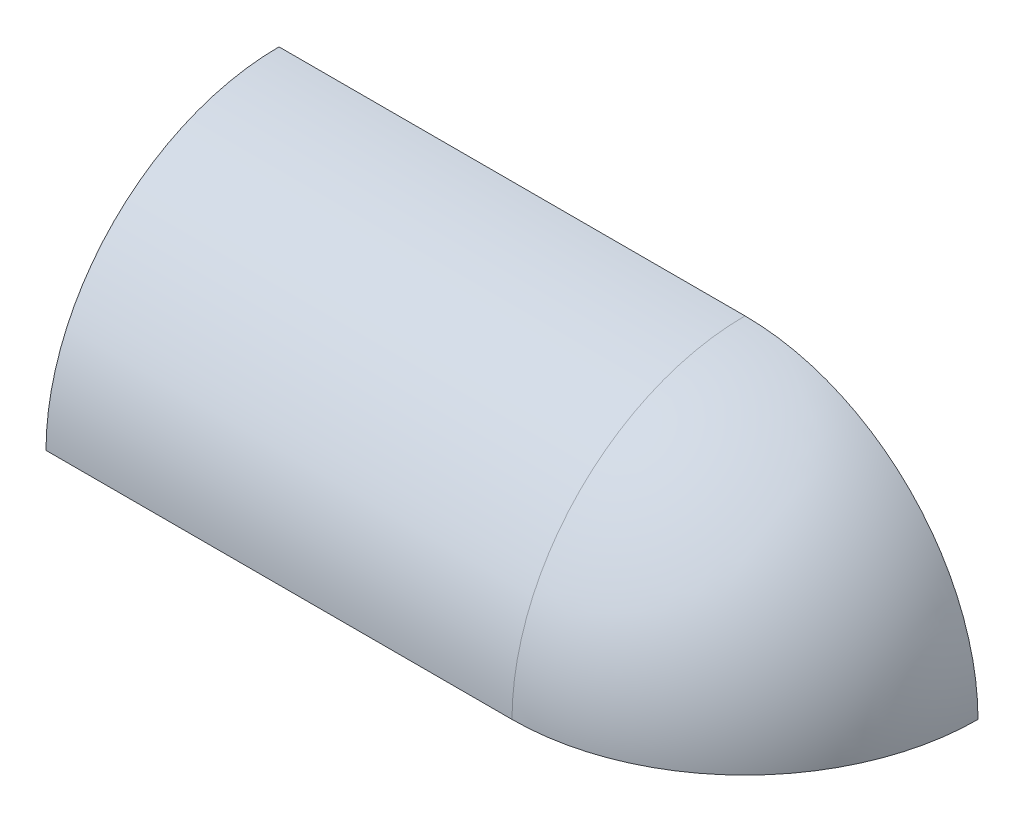
ISO-10303-21;
HEADER;
FILE_DESCRIPTION(('STEP AP214'),'2;1');
FILE_NAME('part.step','',(''),(''),'','','');
FILE_SCHEMA(('AUTOMOTIVE_DESIGN { 1 0 10303 214 1 1 1 1 }'));
ENDSEC;
DATA;
#1=APPLICATION_CONTEXT('core data for automotive mechanical design processes');
#2=APPLICATION_PROTOCOL_DEFINITION('international standard','automotive_design',2000,#1);
#3=PRODUCT_CONTEXT('',#1,'mechanical');
#4=PRODUCT('Part','Part','',(#3));
#5=PRODUCT_RELATED_PRODUCT_CATEGORY('part','',(#4));
#6=PRODUCT_DEFINITION_FORMATION('','',#4);
#7=PRODUCT_DEFINITION_CONTEXT('part definition',#1,'design');
#8=PRODUCT_DEFINITION('design','',#6,#7);
#9=PRODUCT_DEFINITION_SHAPE('','',#8);
#10=(LENGTH_UNIT() NAMED_UNIT(*) SI_UNIT(.MILLI.,.METRE.));
#11=(NAMED_UNIT(*) PLANE_ANGLE_UNIT() SI_UNIT($,.RADIAN.));
#12=(NAMED_UNIT(*) SI_UNIT($,.STERADIAN.) SOLID_ANGLE_UNIT());
#13=UNCERTAINTY_MEASURE_WITH_UNIT(LENGTH_MEASURE(1.E-05),#10,'distance_accuracy_value','');
#14=(GEOMETRIC_REPRESENTATION_CONTEXT(3) GLOBAL_UNCERTAINTY_ASSIGNED_CONTEXT((#13)) GLOBAL_UNIT_ASSIGNED_CONTEXT((#10,
#11,#12)) REPRESENTATION_CONTEXT('',''));
#15=CARTESIAN_POINT('',(0.,0.,0.));
#16=DIRECTION('',(0.,0.,1.));
#17=DIRECTION('',(1.,0.,0.));
#18=AXIS2_PLACEMENT_3D('',#15,#16,#17);
#19=CARTESIAN_POINT('',(101.6,0.,0.));
#20=DIRECTION('',(-1.,0.,0.));
#21=DIRECTION('',(0.,0.,1.));
#22=AXIS2_PLACEMENT_3D('',#19,#20,#21);
#23=CYLINDRICAL_SURFACE('',#22,50.8);
#24=DIRECTION('',(-1.,0.,0.));
#25=VECTOR('',#24,1.);
#26=CARTESIAN_POINT('',(101.6,50.8,0.));
#27=LINE('',#26,#25);
#28=CARTESIAN_POINT('',(0.,50.8,0.));
#29=VERTEX_POINT('',#28);
#30=CARTESIAN_POINT('',(101.6,50.8,0.));
#31=VERTEX_POINT('',#30);
#32=EDGE_CURVE('E86',#29,#31,#27,.F.);
#33=ORIENTED_EDGE('',*,*,#32,.F.);
#34=CARTESIAN_POINT('',(0.,0.,0.));
#35=DIRECTION('',(1.,0.,0.));
#36=DIRECTION('',(0.,0.,-1.));
#37=AXIS2_PLACEMENT_3D('',#34,#35,#36);
#38=CIRCLE('',#37,50.8);
#39=CARTESIAN_POINT('',(0.,0.,50.8));
#40=VERTEX_POINT('',#39);
#41=EDGE_CURVE('E78',#29,#40,#38,.T.);
#42=ORIENTED_EDGE('',*,*,#41,.T.);
#43=DIRECTION('',(-1.,0.,0.));
#44=VECTOR('',#43,1.);
#45=CARTESIAN_POINT('',(101.6,0.,50.8));
#46=LINE('',#45,#44);
#47=CARTESIAN_POINT('',(101.6,0.,50.8));
#48=VERTEX_POINT('',#47);
#49=EDGE_CURVE('E84',#40,#48,#46,.F.);
#50=ORIENTED_EDGE('',*,*,#49,.T.);
#51=CARTESIAN_POINT('',(101.6,0.,0.));
#52=DIRECTION('',(1.,0.,0.));
#53=DIRECTION('',(0.,0.,-1.));
#54=AXIS2_PLACEMENT_3D('',#51,#52,#53);
#55=CIRCLE('',#54,50.8);
#56=EDGE_CURVE('E107',#31,#48,#55,.T.);
#57=ORIENTED_EDGE('',*,*,#56,.F.);
#58=EDGE_LOOP('',(#33,#42,#50,#57));
#59=FACE_BOUND('',#58,.T.);
#60=ADVANCED_FACE('F34',(#59),#23,.T.);
#61=CARTESIAN_POINT('',(101.6,0.,0.));
#62=DIRECTION('',(1.,0.,0.));
#63=DIRECTION('',(0.,1.,0.));
#64=AXIS2_PLACEMENT_3D('',#61,#62,#63);
#65=SPHERICAL_SURFACE('',#64,50.8);
#66=ORIENTED_EDGE('',*,*,#56,.T.);
#67=CARTESIAN_POINT('',(101.6,0.,0.));
#68=DIRECTION('',(0.,1.,0.));
#69=DIRECTION('',(0.,0.,1.));
#70=AXIS2_PLACEMENT_3D('',#67,#68,#69);
#71=CIRCLE('',#70,50.8);
#72=CARTESIAN_POINT('',(152.4,0.,0.));
#73=VERTEX_POINT('',#72);
#74=EDGE_CURVE('E91',#48,#73,#71,.T.);
#75=ORIENTED_EDGE('',*,*,#74,.T.);
#76=CARTESIAN_POINT('',(101.6,0.,0.));
#77=DIRECTION('',(0.,0.,-1.));
#78=DIRECTION('',(-1.,0.,0.));
#79=AXIS2_PLACEMENT_3D('',#76,#77,#78);
#80=CIRCLE('',#79,50.8);
#81=EDGE_CURVE('E95',#31,#73,#80,.T.);
#82=ORIENTED_EDGE('',*,*,#81,.F.);
#83=EDGE_LOOP('',(#66,#75,#82));
#84=FACE_BOUND('',#83,.T.);
#85=ADVANCED_FACE('F126',(#84),#65,.T.);
#86=CARTESIAN_POINT('',(0.,0.,0.));
#87=DIRECTION('',(0.,0.,-1.));
#88=DIRECTION('',(-1.,0.,0.));
#89=AXIS2_PLACEMENT_3D('',#86,#87,#88);
#90=PLANE('',#89);
#91=DIRECTION('',(0.,-1.,0.));
#92=VECTOR('',#91,1.);
#93=CARTESIAN_POINT('',(0.,0.,0.));
#94=LINE('',#93,#92);
#95=CARTESIAN_POINT('',(0.,47.625,0.));
#96=VERTEX_POINT('',#95);
#97=EDGE_CURVE('E87',#29,#96,#94,.T.);
#98=ORIENTED_EDGE('',*,*,#97,.F.);
#99=ORIENTED_EDGE('',*,*,#32,.T.);
#100=ORIENTED_EDGE('',*,*,#81,.T.);
#101=DIRECTION('',(1.,0.,0.));
#102=VECTOR('',#101,1.);
#103=CARTESIAN_POINT('',(0.,0.,0.));
#104=LINE('',#103,#102);
#105=CARTESIAN_POINT('',(149.225,0.,0.));
#106=VERTEX_POINT('',#105);
#107=EDGE_CURVE('E97',#106,#73,#104,.T.);
#108=ORIENTED_EDGE('',*,*,#107,.F.);
#109=CARTESIAN_POINT('',(101.6,0.,0.));
#110=DIRECTION('',(0.,0.,-1.));
#111=DIRECTION('',(-1.,0.,0.));
#112=AXIS2_PLACEMENT_3D('',#109,#110,#111);
#113=CIRCLE('',#112,47.625);
#114=CARTESIAN_POINT('',(101.6,47.625,0.));
#115=VERTEX_POINT('',#114);
#116=EDGE_CURVE('E109',#115,#106,#113,.T.);
#117=ORIENTED_EDGE('',*,*,#116,.F.);
#118=DIRECTION('',(-1.,0.,0.));
#119=VECTOR('',#118,1.);
#120=CARTESIAN_POINT('',(101.6,47.625,0.));
#121=LINE('',#120,#119);
#122=EDGE_CURVE('E93',#96,#115,#121,.F.);
#123=ORIENTED_EDGE('',*,*,#122,.F.);
#124=EDGE_LOOP('',(#98,#99,#100,#108,#117,#123));
#125=FACE_BOUND('',#124,.T.);
#126=ADVANCED_FACE('F116',(#125),#90,.T.);
#127=CARTESIAN_POINT('',(101.6,0.,0.));
#128=DIRECTION('',(-1.,0.,0.));
#129=DIRECTION('',(0.,0.,1.));
#130=AXIS2_PLACEMENT_3D('',#127,#128,#129);
#131=CYLINDRICAL_SURFACE('',#130,47.625);
#132=CARTESIAN_POINT('',(0.,0.,0.));
#133=DIRECTION('',(1.,0.,0.));
#134=DIRECTION('',(0.,0.,-1.));
#135=AXIS2_PLACEMENT_3D('',#132,#133,#134);
#136=CIRCLE('',#135,47.625);
#137=CARTESIAN_POINT('',(0.,0.,47.625));
#138=VERTEX_POINT('',#137);
#139=EDGE_CURVE('E48',#96,#138,#136,.T.);
#140=ORIENTED_EDGE('',*,*,#139,.F.);
#141=ORIENTED_EDGE('',*,*,#122,.T.);
#142=CARTESIAN_POINT('',(101.6,0.,0.));
#143=DIRECTION('',(1.,0.,0.));
#144=DIRECTION('',(0.,1.,0.));
#145=AXIS2_PLACEMENT_3D('',#142,#143,#144);
#146=CIRCLE('',#145,47.625);
#147=CARTESIAN_POINT('',(101.6,0.,47.625));
#148=VERTEX_POINT('',#147);
#149=EDGE_CURVE('E104',#115,#148,#146,.T.);
#150=ORIENTED_EDGE('',*,*,#149,.T.);
#151=DIRECTION('',(-1.,0.,0.));
#152=VECTOR('',#151,1.);
#153=CARTESIAN_POINT('',(101.6,0.,47.625));
#154=LINE('',#153,#152);
#155=EDGE_CURVE('E54',#138,#148,#154,.F.);
#156=ORIENTED_EDGE('',*,*,#155,.F.);
#157=EDGE_LOOP('',(#140,#141,#150,#156));
#158=FACE_BOUND('',#157,.T.);
#159=ADVANCED_FACE('F121',(#158),#131,.F.);
#160=CARTESIAN_POINT('',(101.6,0.,0.));
#161=DIRECTION('',(1.,0.,0.));
#162=DIRECTION('',(0.,1.,0.));
#163=AXIS2_PLACEMENT_3D('',#160,#161,#162);
#164=SPHERICAL_SURFACE('',#163,47.625);
#165=CARTESIAN_POINT('',(101.6,0.,0.));
#166=DIRECTION('',(0.,1.,0.));
#167=DIRECTION('',(0.,0.,1.));
#168=AXIS2_PLACEMENT_3D('',#165,#166,#167);
#169=CIRCLE('',#168,47.625);
#170=EDGE_CURVE('E41',#148,#106,#169,.T.);
#171=ORIENTED_EDGE('',*,*,#170,.F.);
#172=ORIENTED_EDGE('',*,*,#149,.F.);
#173=ORIENTED_EDGE('',*,*,#116,.T.);
#174=EDGE_LOOP('',(#171,#172,#173));
#175=FACE_BOUND('',#174,.T.);
#176=ADVANCED_FACE('F119',(#175),#164,.F.);
#177=CARTESIAN_POINT('',(0.,0.,0.));
#178=DIRECTION('',(0.,1.,0.));
#179=DIRECTION('',(0.,0.,1.));
#180=AXIS2_PLACEMENT_3D('',#177,#178,#179);
#181=PLANE('',#180);
#182=ORIENTED_EDGE('',*,*,#49,.F.);
#183=DIRECTION('',(0.,0.,-1.));
#184=VECTOR('',#183,1.);
#185=CARTESIAN_POINT('',(0.,0.,0.));
#186=LINE('',#185,#184);
#187=EDGE_CURVE('E11',#40,#138,#186,.T.);
#188=ORIENTED_EDGE('',*,*,#187,.T.);
#189=ORIENTED_EDGE('',*,*,#155,.T.);
#190=ORIENTED_EDGE('',*,*,#170,.T.);
#191=ORIENTED_EDGE('',*,*,#107,.T.);
#192=ORIENTED_EDGE('',*,*,#74,.F.);
#193=EDGE_LOOP('',(#182,#188,#189,#190,#191,#192));
#194=FACE_BOUND('',#193,.T.);
#195=ADVANCED_FACE('F89',(#194),#181,.F.);
#196=CARTESIAN_POINT('',(0.,0.,0.));
#197=DIRECTION('',(1.,0.,0.));
#198=DIRECTION('',(0.,0.,-1.));
#199=AXIS2_PLACEMENT_3D('',#196,#197,#198);
#200=PLANE('',#199);
#201=ORIENTED_EDGE('',*,*,#97,.T.);
#202=ORIENTED_EDGE('',*,*,#139,.T.);
#203=ORIENTED_EDGE('',*,*,#187,.F.);
#204=ORIENTED_EDGE('',*,*,#41,.F.);
#205=EDGE_LOOP('',(#201,#202,#203,#204));
#206=FACE_BOUND('',#205,.T.);
#207=ADVANCED_FACE('F77',(#206),#200,.F.);
#208=CLOSED_SHELL('',(#60,#85,#126,#159,#176,#195,#207));
#209=MANIFOLD_SOLID_BREP('B2',#208);
#210=ADVANCED_BREP_SHAPE_REPRESENTATION('',(#18,#209),#14);
#211=SHAPE_DEFINITION_REPRESENTATION(#9,#210);
ENDSEC;
END-ISO-10303-21;
